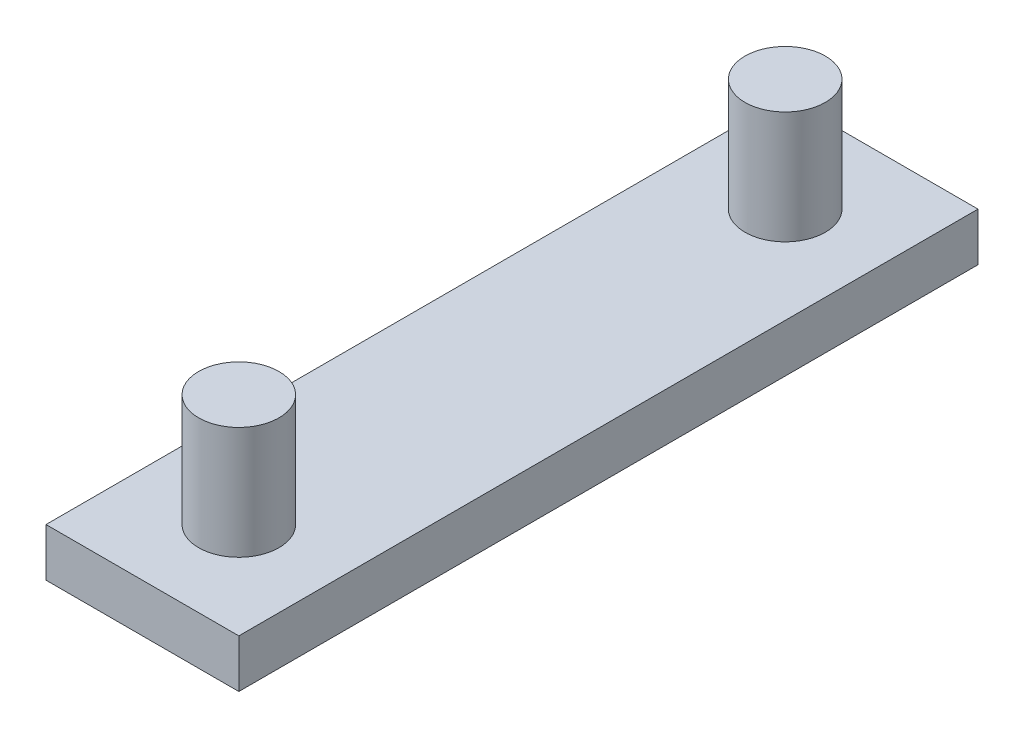
ISO-10303-21;
HEADER;
FILE_DESCRIPTION(('STEP AP214'),'2;1');
FILE_NAME('part.step','',(''),(''),'','','');
FILE_SCHEMA(('AUTOMOTIVE_DESIGN { 1 0 10303 214 1 1 1 1 }'));
ENDSEC;
DATA;
#1=APPLICATION_CONTEXT('core data for automotive mechanical design processes');
#2=APPLICATION_PROTOCOL_DEFINITION('international standard','automotive_design',2000,#1);
#3=PRODUCT_CONTEXT('',#1,'mechanical');
#4=PRODUCT('Part','Part','',(#3));
#5=PRODUCT_RELATED_PRODUCT_CATEGORY('part','',(#4));
#6=PRODUCT_DEFINITION_FORMATION('','',#4);
#7=PRODUCT_DEFINITION_CONTEXT('part definition',#1,'design');
#8=PRODUCT_DEFINITION('design','',#6,#7);
#9=PRODUCT_DEFINITION_SHAPE('','',#8);
#10=(LENGTH_UNIT() NAMED_UNIT(*) SI_UNIT(.MILLI.,.METRE.));
#11=(NAMED_UNIT(*) PLANE_ANGLE_UNIT() SI_UNIT($,.RADIAN.));
#12=(NAMED_UNIT(*) SI_UNIT($,.STERADIAN.) SOLID_ANGLE_UNIT());
#13=UNCERTAINTY_MEASURE_WITH_UNIT(LENGTH_MEASURE(1.E-05),#10,'distance_accuracy_value','');
#14=(GEOMETRIC_REPRESENTATION_CONTEXT(3) GLOBAL_UNCERTAINTY_ASSIGNED_CONTEXT((#13)) GLOBAL_UNIT_ASSIGNED_CONTEXT((#10,
#11,#12)) REPRESENTATION_CONTEXT('',''));
#15=CARTESIAN_POINT('',(0.,0.,0.));
#16=DIRECTION('',(0.,0.,1.));
#17=DIRECTION('',(1.,0.,0.));
#18=AXIS2_PLACEMENT_3D('',#15,#16,#17);
#19=CARTESIAN_POINT('',(-0.169934853158514,10.,-17.1433063666727));
#20=DIRECTION('',(0.,-1.,0.));
#21=DIRECTION('',(0.,0.,-1.));
#22=AXIS2_PLACEMENT_3D('',#19,#20,#21);
#23=CYLINDRICAL_SURFACE('',#22,2.5);
#24=CARTESIAN_POINT('',(-0.169934853158514,10.,-17.1433063666727));
#25=DIRECTION('',(0.,1.,0.));
#26=DIRECTION('',(0.,0.,1.));
#27=AXIS2_PLACEMENT_3D('',#24,#25,#26);
#28=CIRCLE('',#27,2.5);
#29=CARTESIAN_POINT('',(-0.169934853158514,10.,-14.6433063666727));
#30=VERTEX_POINT('',#29);
#31=EDGE_CURVE('E110',#30,#30,#28,.T.);
#32=ORIENTED_EDGE('',*,*,#31,.F.);
#33=EDGE_LOOP('',(#32));
#34=FACE_BOUND('',#33,.T.);
#35=CARTESIAN_POINT('',(-0.169934853158514,3.,-17.1433063666727));
#36=DIRECTION('',(0.,-1.,0.));
#37=DIRECTION('',(0.,0.,-1.));
#38=AXIS2_PLACEMENT_3D('',#35,#36,#37);
#39=CIRCLE('',#38,2.5);
#40=CARTESIAN_POINT('',(-0.169934853158514,3.,-19.6433063666727));
#41=VERTEX_POINT('',#40);
#42=EDGE_CURVE('E36',#41,#41,#39,.T.);
#43=ORIENTED_EDGE('',*,*,#42,.F.);
#44=EDGE_LOOP('',(#43));
#45=FACE_BOUND('',#44,.T.);
#46=ADVANCED_FACE('F33',(#34,#45),#23,.T.);
#47=CARTESIAN_POINT('',(-0.169934853158514,10.,-17.1433063666727));
#48=DIRECTION('',(0.,1.,0.));
#49=DIRECTION('',(0.,0.,1.));
#50=AXIS2_PLACEMENT_3D('',#47,#48,#49);
#51=PLANE('',#50);
#52=ORIENTED_EDGE('',*,*,#31,.T.);
#53=EDGE_LOOP('',(#52));
#54=FACE_BOUND('',#53,.T.);
#55=ADVANCED_FACE('F119',(#54),#51,.T.);
#56=CARTESIAN_POINT('',(-6.16993485315851,3.,22.8566936333273));
#57=DIRECTION('',(1.,0.,0.));
#58=DIRECTION('',(0.,0.,-1.));
#59=AXIS2_PLACEMENT_3D('',#56,#57,#58);
#60=PLANE('',#59);
#61=DIRECTION('',(0.,0.,1.));
#62=VECTOR('',#61,1.);
#63=CARTESIAN_POINT('',(-6.16993485315851,0.,22.8566936333273));
#64=LINE('',#63,#62);
#65=CARTESIAN_POINT('',(-6.16993485315851,0.,-23.1433063666727));
#66=VERTEX_POINT('',#65);
#67=CARTESIAN_POINT('',(-6.16993485315851,0.,22.8566936333273));
#68=VERTEX_POINT('',#67);
#69=EDGE_CURVE('E101',#66,#68,#64,.T.);
#70=ORIENTED_EDGE('',*,*,#69,.T.);
#71=DIRECTION('',(0.,-1.,0.));
#72=VECTOR('',#71,1.);
#73=CARTESIAN_POINT('',(-6.16993485315851,3.,22.8566936333273));
#74=LINE('',#73,#72);
#75=CARTESIAN_POINT('',(-6.16993485315851,3.,22.8566936333273));
#76=VERTEX_POINT('',#75);
#77=EDGE_CURVE('E92',#76,#68,#74,.T.);
#78=ORIENTED_EDGE('',*,*,#77,.F.);
#79=DIRECTION('',(0.,0.,1.));
#80=VECTOR('',#79,1.);
#81=CARTESIAN_POINT('',(-6.16993485315851,3.,22.8566936333273));
#82=LINE('',#81,#80);
#83=CARTESIAN_POINT('',(-6.16993485315851,3.,-23.1433063666727));
#84=VERTEX_POINT('',#83);
#85=EDGE_CURVE('E86',#84,#76,#82,.T.);
#86=ORIENTED_EDGE('',*,*,#85,.F.);
#87=DIRECTION('',(0.,-1.,0.));
#88=VECTOR('',#87,1.);
#89=CARTESIAN_POINT('',(-6.16993485315851,3.,-23.1433063666727));
#90=LINE('',#89,#88);
#91=EDGE_CURVE('E97',#84,#66,#90,.T.);
#92=ORIENTED_EDGE('',*,*,#91,.T.);
#93=EDGE_LOOP('',(#70,#78,#86,#92));
#94=FACE_BOUND('',#93,.T.);
#95=ADVANCED_FACE('F124',(#94),#60,.F.);
#96=CARTESIAN_POINT('',(-6.16993485315851,3.,22.8566936333273));
#97=DIRECTION('',(0.,0.,-1.));
#98=DIRECTION('',(-1.,0.,0.));
#99=AXIS2_PLACEMENT_3D('',#96,#97,#98);
#100=PLANE('',#99);
#101=DIRECTION('',(1.,0.,0.));
#102=VECTOR('',#101,1.);
#103=CARTESIAN_POINT('',(-6.16993485315851,0.,22.8566936333273));
#104=LINE('',#103,#102);
#105=CARTESIAN_POINT('',(5.83006514684149,0.,22.8566936333273));
#106=VERTEX_POINT('',#105);
#107=EDGE_CURVE('E91',#68,#106,#104,.T.);
#108=ORIENTED_EDGE('',*,*,#107,.T.);
#109=DIRECTION('',(0.,-1.,0.));
#110=VECTOR('',#109,1.);
#111=CARTESIAN_POINT('',(5.83006514684149,3.,22.8566936333273));
#112=LINE('',#111,#110);
#113=CARTESIAN_POINT('',(5.83006514684149,3.,22.8566936333273));
#114=VERTEX_POINT('',#113);
#115=EDGE_CURVE('E89',#114,#106,#112,.T.);
#116=ORIENTED_EDGE('',*,*,#115,.F.);
#117=DIRECTION('',(1.,0.,0.));
#118=VECTOR('',#117,1.);
#119=CARTESIAN_POINT('',(-6.16993485315851,3.,22.8566936333273));
#120=LINE('',#119,#118);
#121=EDGE_CURVE('E81',#76,#114,#120,.T.);
#122=ORIENTED_EDGE('',*,*,#121,.F.);
#123=ORIENTED_EDGE('',*,*,#77,.T.);
#124=EDGE_LOOP('',(#108,#116,#122,#123));
#125=FACE_BOUND('',#124,.T.);
#126=ADVANCED_FACE('F90',(#125),#100,.F.);
#127=CARTESIAN_POINT('',(5.83006514684149,3.,22.8566936333273));
#128=DIRECTION('',(-1.,0.,0.));
#129=DIRECTION('',(0.,0.,1.));
#130=AXIS2_PLACEMENT_3D('',#127,#128,#129);
#131=PLANE('',#130);
#132=DIRECTION('',(0.,0.,-1.));
#133=VECTOR('',#132,1.);
#134=CARTESIAN_POINT('',(5.83006514684149,0.,22.8566936333273));
#135=LINE('',#134,#133);
#136=CARTESIAN_POINT('',(5.83006514684149,0.,-23.1433063666727));
#137=VERTEX_POINT('',#136);
#138=EDGE_CURVE('E67',#106,#137,#135,.T.);
#139=ORIENTED_EDGE('',*,*,#138,.T.);
#140=DIRECTION('',(0.,-1.,0.));
#141=VECTOR('',#140,1.);
#142=CARTESIAN_POINT('',(5.83006514684149,3.,-23.1433063666727));
#143=LINE('',#142,#141);
#144=CARTESIAN_POINT('',(5.83006514684149,3.,-23.1433063666727));
#145=VERTEX_POINT('',#144);
#146=EDGE_CURVE('E93',#145,#137,#143,.T.);
#147=ORIENTED_EDGE('',*,*,#146,.F.);
#148=DIRECTION('',(0.,0.,-1.));
#149=VECTOR('',#148,1.);
#150=CARTESIAN_POINT('',(5.83006514684149,3.,22.8566936333273));
#151=LINE('',#150,#149);
#152=EDGE_CURVE('E84',#114,#145,#151,.T.);
#153=ORIENTED_EDGE('',*,*,#152,.F.);
#154=ORIENTED_EDGE('',*,*,#115,.T.);
#155=EDGE_LOOP('',(#139,#147,#153,#154));
#156=FACE_BOUND('',#155,.T.);
#157=ADVANCED_FACE('F95',(#156),#131,.F.);
#158=CARTESIAN_POINT('',(-6.16993485315851,3.,-23.1433063666727));
#159=DIRECTION('',(0.,0.,1.));
#160=DIRECTION('',(1.,0.,0.));
#161=AXIS2_PLACEMENT_3D('',#158,#159,#160);
#162=PLANE('',#161);
#163=DIRECTION('',(-1.,0.,0.));
#164=VECTOR('',#163,1.);
#165=CARTESIAN_POINT('',(-6.16993485315851,0.,-23.1433063666727));
#166=LINE('',#165,#164);
#167=EDGE_CURVE('E73',#137,#66,#166,.T.);
#168=ORIENTED_EDGE('',*,*,#167,.T.);
#169=ORIENTED_EDGE('',*,*,#91,.F.);
#170=DIRECTION('',(-1.,0.,0.));
#171=VECTOR('',#170,1.);
#172=CARTESIAN_POINT('',(-6.16993485315851,3.,-23.1433063666727));
#173=LINE('',#172,#171);
#174=EDGE_CURVE('E50',#145,#84,#173,.T.);
#175=ORIENTED_EDGE('',*,*,#174,.F.);
#176=ORIENTED_EDGE('',*,*,#146,.T.);
#177=EDGE_LOOP('',(#168,#169,#175,#176));
#178=FACE_BOUND('',#177,.T.);
#179=ADVANCED_FACE('F143',(#178),#162,.F.);
#180=CARTESIAN_POINT('',(0.,3.,0.));
#181=DIRECTION('',(0.,-1.,0.));
#182=DIRECTION('',(0.,0.,-1.));
#183=AXIS2_PLACEMENT_3D('',#180,#181,#182);
#184=PLANE('',#183);
#185=CARTESIAN_POINT('',(-0.16993485315851,3.,16.8566936333273));
#186=DIRECTION('',(0.,-1.,0.));
#187=DIRECTION('',(0.,0.,-1.));
#188=AXIS2_PLACEMENT_3D('',#185,#186,#187);
#189=CIRCLE('',#188,2.5);
#190=CARTESIAN_POINT('',(-0.16993485315851,3.,14.3566936333273));
#191=VERTEX_POINT('',#190);
#192=EDGE_CURVE('E11',#191,#191,#189,.F.);
#193=ORIENTED_EDGE('',*,*,#192,.F.);
#194=EDGE_LOOP('',(#193));
#195=FACE_BOUND('',#194,.T.);
#196=ORIENTED_EDGE('',*,*,#42,.T.);
#197=EDGE_LOOP('',(#196));
#198=FACE_BOUND('',#197,.T.);
#199=ORIENTED_EDGE('',*,*,#85,.T.);
#200=ORIENTED_EDGE('',*,*,#121,.T.);
#201=ORIENTED_EDGE('',*,*,#152,.T.);
#202=ORIENTED_EDGE('',*,*,#174,.T.);
#203=EDGE_LOOP('',(#199,#200,#201,#202));
#204=FACE_BOUND('',#203,.T.);
#205=ADVANCED_FACE('F82',(#195,#198,#204),#184,.F.);
#206=CARTESIAN_POINT('',(-0.169934853158514,0.,-17.1433063666727));
#207=DIRECTION('',(0.,1.,0.));
#208=DIRECTION('',(0.,0.,1.));
#209=AXIS2_PLACEMENT_3D('',#206,#207,#208);
#210=PLANE('',#209);
#211=ORIENTED_EDGE('',*,*,#69,.F.);
#212=ORIENTED_EDGE('',*,*,#167,.F.);
#213=ORIENTED_EDGE('',*,*,#138,.F.);
#214=ORIENTED_EDGE('',*,*,#107,.F.);
#215=EDGE_LOOP('',(#211,#212,#213,#214));
#216=FACE_BOUND('',#215,.T.);
#217=ADVANCED_FACE('F132',(#216),#210,.F.);
#218=CARTESIAN_POINT('',(-0.16993485315851,10.,16.8566936333273));
#219=DIRECTION('',(0.,-1.,0.));
#220=DIRECTION('',(0.,0.,-1.));
#221=AXIS2_PLACEMENT_3D('',#218,#219,#220);
#222=CYLINDRICAL_SURFACE('',#221,2.5);
#223=CARTESIAN_POINT('',(-0.16993485315851,10.,16.8566936333273));
#224=DIRECTION('',(0.,1.,0.));
#225=DIRECTION('',(0.,0.,-1.));
#226=AXIS2_PLACEMENT_3D('',#223,#224,#225);
#227=CIRCLE('',#226,2.5);
#228=CARTESIAN_POINT('',(-0.16993485315851,10.,14.3566936333273));
#229=VERTEX_POINT('',#228);
#230=EDGE_CURVE('E104',#229,#229,#227,.T.);
#231=ORIENTED_EDGE('',*,*,#230,.F.);
#232=EDGE_LOOP('',(#231));
#233=FACE_BOUND('',#232,.T.);
#234=ORIENTED_EDGE('',*,*,#192,.T.);
#235=EDGE_LOOP('',(#234));
#236=FACE_BOUND('',#235,.T.);
#237=ADVANCED_FACE('F134',(#233,#236),#222,.T.);
#238=CARTESIAN_POINT('',(-0.16993485315851,10.,16.8566936333273));
#239=DIRECTION('',(0.,-1.,0.));
#240=DIRECTION('',(0.,0.,-1.));
#241=AXIS2_PLACEMENT_3D('',#238,#239,#240);
#242=PLANE('',#241);
#243=ORIENTED_EDGE('',*,*,#230,.T.);
#244=EDGE_LOOP('',(#243));
#245=FACE_BOUND('',#244,.T.);
#246=ADVANCED_FACE('F140',(#245),#242,.F.);
#247=CLOSED_SHELL('',(#46,#55,#95,#126,#157,#179,#205,#217,#237,#246));
#248=MANIFOLD_SOLID_BREP('B2',#247);
#249=ADVANCED_BREP_SHAPE_REPRESENTATION('',(#18,#248),#14);
#250=SHAPE_DEFINITION_REPRESENTATION(#9,#249);
ENDSEC;
END-ISO-10303-21;
